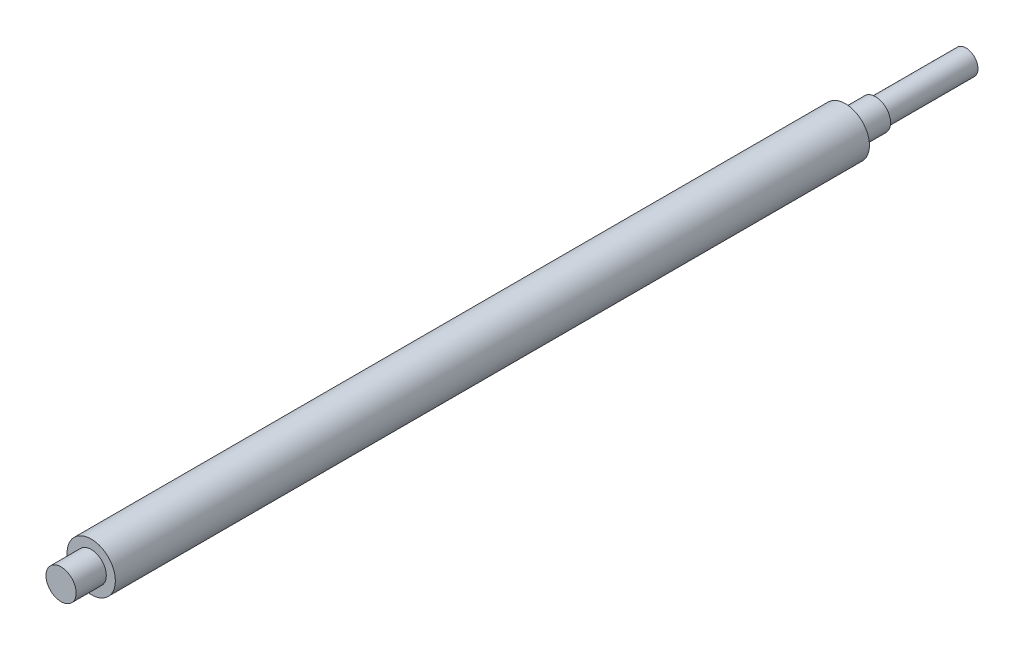
ISO-10303-21;
HEADER;
FILE_DESCRIPTION(('STEP AP214'),'2;1');
FILE_NAME('part.step','',(''),(''),'','','');
FILE_SCHEMA(('AUTOMOTIVE_DESIGN { 1 0 10303 214 1 1 1 1 }'));
ENDSEC;
DATA;
#1=APPLICATION_CONTEXT('core data for automotive mechanical design processes');
#2=APPLICATION_PROTOCOL_DEFINITION('international standard','automotive_design',2000,#1);
#3=PRODUCT_CONTEXT('',#1,'mechanical');
#4=PRODUCT('Part','Part','',(#3));
#5=PRODUCT_RELATED_PRODUCT_CATEGORY('part','',(#4));
#6=PRODUCT_DEFINITION_FORMATION('','',#4);
#7=PRODUCT_DEFINITION_CONTEXT('part definition',#1,'design');
#8=PRODUCT_DEFINITION('design','',#6,#7);
#9=PRODUCT_DEFINITION_SHAPE('','',#8);
#10=(LENGTH_UNIT() NAMED_UNIT(*) SI_UNIT(.MILLI.,.METRE.));
#11=(NAMED_UNIT(*) PLANE_ANGLE_UNIT() SI_UNIT($,.RADIAN.));
#12=(NAMED_UNIT(*) SI_UNIT($,.STERADIAN.) SOLID_ANGLE_UNIT());
#13=UNCERTAINTY_MEASURE_WITH_UNIT(LENGTH_MEASURE(1.E-05),#10,'distance_accuracy_value','');
#14=(GEOMETRIC_REPRESENTATION_CONTEXT(3) GLOBAL_UNCERTAINTY_ASSIGNED_CONTEXT((#13)) GLOBAL_UNIT_ASSIGNED_CONTEXT((#10,
#11,#12)) REPRESENTATION_CONTEXT('',''));
#15=CARTESIAN_POINT('',(0.,0.,0.));
#16=DIRECTION('',(0.,0.,1.));
#17=DIRECTION('',(1.,0.,0.));
#18=AXIS2_PLACEMENT_3D('',#15,#16,#17);
#19=CARTESIAN_POINT('',(0.,0.,250.));
#20=DIRECTION('',(0.,0.,-1.));
#21=DIRECTION('',(-1.,0.,0.));
#22=AXIS2_PLACEMENT_3D('',#19,#20,#21);
#23=CYLINDRICAL_SURFACE('',#22,8.);
#24=CARTESIAN_POINT('',(0.,0.,250.));
#25=DIRECTION('',(0.,0.,1.));
#26=DIRECTION('',(1.,0.,0.));
#27=AXIS2_PLACEMENT_3D('',#24,#25,#26);
#28=CIRCLE('',#27,8.);
#29=CARTESIAN_POINT('',(8.,0.,250.));
#30=VERTEX_POINT('',#29);
#31=EDGE_CURVE('E71',#30,#30,#28,.T.);
#32=ORIENTED_EDGE('',*,*,#31,.F.);
#33=EDGE_LOOP('',(#32));
#34=FACE_BOUND('',#33,.T.);
#35=CARTESIAN_POINT('',(0.,0.,0.));
#36=DIRECTION('',(0.,0.,1.));
#37=DIRECTION('',(1.,0.,0.));
#38=AXIS2_PLACEMENT_3D('',#35,#36,#37);
#39=CIRCLE('',#38,8.);
#40=CARTESIAN_POINT('',(8.,0.,0.));
#41=VERTEX_POINT('',#40);
#42=EDGE_CURVE('E45',#41,#41,#39,.T.);
#43=ORIENTED_EDGE('',*,*,#42,.T.);
#44=EDGE_LOOP('',(#43));
#45=FACE_BOUND('',#44,.T.);
#46=ADVANCED_FACE('F42',(#34,#45),#23,.T.);
#47=CARTESIAN_POINT('',(0.,0.,250.));
#48=DIRECTION('',(0.,0.,1.));
#49=DIRECTION('',(1.,0.,0.));
#50=AXIS2_PLACEMENT_3D('',#47,#48,#49);
#51=PLANE('',#50);
#52=CARTESIAN_POINT('',(0.,0.,250.));
#53=DIRECTION('',(0.,0.,1.));
#54=DIRECTION('',(1.,0.,0.));
#55=AXIS2_PLACEMENT_3D('',#52,#53,#54);
#56=CIRCLE('',#55,5.);
#57=CARTESIAN_POINT('',(5.,0.,250.));
#58=VERTEX_POINT('',#57);
#59=EDGE_CURVE('E56',#58,#58,#56,.T.);
#60=ORIENTED_EDGE('',*,*,#59,.F.);
#61=EDGE_LOOP('',(#60));
#62=FACE_BOUND('',#61,.T.);
#63=ORIENTED_EDGE('',*,*,#31,.T.);
#64=EDGE_LOOP('',(#63));
#65=FACE_BOUND('',#64,.T.);
#66=ADVANCED_FACE('F84',(#62,#65),#51,.T.);
#67=CARTESIAN_POINT('',(0.,0.,0.));
#68=DIRECTION('',(0.,0.,1.));
#69=DIRECTION('',(1.,0.,0.));
#70=AXIS2_PLACEMENT_3D('',#67,#68,#69);
#71=PLANE('',#70);
#72=CARTESIAN_POINT('',(0.,0.,0.));
#73=DIRECTION('',(0.,0.,-1.));
#74=DIRECTION('',(-1.,0.,0.));
#75=AXIS2_PLACEMENT_3D('',#72,#73,#74);
#76=CIRCLE('',#75,5.);
#77=CARTESIAN_POINT('',(-5.,0.,0.));
#78=VERTEX_POINT('',#77);
#79=EDGE_CURVE('E50',#78,#78,#76,.T.);
#80=ORIENTED_EDGE('',*,*,#79,.F.);
#81=EDGE_LOOP('',(#80));
#82=FACE_BOUND('',#81,.T.);
#83=ORIENTED_EDGE('',*,*,#42,.F.);
#84=EDGE_LOOP('',(#83));
#85=FACE_BOUND('',#84,.T.);
#86=ADVANCED_FACE('F81',(#82,#85),#71,.F.);
#87=CARTESIAN_POINT('',(0.,0.,260.));
#88=DIRECTION('',(0.,0.,-1.));
#89=DIRECTION('',(-1.,0.,0.));
#90=AXIS2_PLACEMENT_3D('',#87,#88,#89);
#91=CYLINDRICAL_SURFACE('',#90,5.);
#92=CARTESIAN_POINT('',(0.,0.,260.));
#93=DIRECTION('',(0.,0.,1.));
#94=DIRECTION('',(1.,0.,0.));
#95=AXIS2_PLACEMENT_3D('',#92,#93,#94);
#96=CIRCLE('',#95,5.);
#97=CARTESIAN_POINT('',(5.,0.,260.));
#98=VERTEX_POINT('',#97);
#99=EDGE_CURVE('E64',#98,#98,#96,.T.);
#100=ORIENTED_EDGE('',*,*,#99,.F.);
#101=EDGE_LOOP('',(#100));
#102=FACE_BOUND('',#101,.T.);
#103=ORIENTED_EDGE('',*,*,#59,.T.);
#104=EDGE_LOOP('',(#103));
#105=FACE_BOUND('',#104,.T.);
#106=ADVANCED_FACE('F83',(#102,#105),#91,.T.);
#107=CARTESIAN_POINT('',(0.,0.,260.));
#108=DIRECTION('',(0.,0.,1.));
#109=DIRECTION('',(1.,0.,0.));
#110=AXIS2_PLACEMENT_3D('',#107,#108,#109);
#111=PLANE('',#110);
#112=ORIENTED_EDGE('',*,*,#99,.T.);
#113=EDGE_LOOP('',(#112));
#114=FACE_BOUND('',#113,.T.);
#115=ADVANCED_FACE('F91',(#114),#111,.T.);
#116=CARTESIAN_POINT('',(0.,0.,-10.));
#117=DIRECTION('',(0.,0.,1.));
#118=DIRECTION('',(1.,0.,0.));
#119=AXIS2_PLACEMENT_3D('',#116,#117,#118);
#120=CYLINDRICAL_SURFACE('',#119,5.);
#121=CARTESIAN_POINT('',(0.,0.,-10.));
#122=DIRECTION('',(0.,0.,-1.));
#123=DIRECTION('',(-1.,0.,0.));
#124=AXIS2_PLACEMENT_3D('',#121,#122,#123);
#125=CIRCLE('',#124,5.);
#126=CARTESIAN_POINT('',(-5.,0.,-10.));
#127=VERTEX_POINT('',#126);
#128=EDGE_CURVE('E61',#127,#127,#125,.T.);
#129=ORIENTED_EDGE('',*,*,#128,.F.);
#130=EDGE_LOOP('',(#129));
#131=FACE_BOUND('',#130,.T.);
#132=ORIENTED_EDGE('',*,*,#79,.T.);
#133=EDGE_LOOP('',(#132));
#134=FACE_BOUND('',#133,.T.);
#135=ADVANCED_FACE('F117',(#131,#134),#120,.T.);
#136=CARTESIAN_POINT('',(0.,0.,-10.));
#137=DIRECTION('',(0.,0.,-1.));
#138=DIRECTION('',(-1.,0.,0.));
#139=AXIS2_PLACEMENT_3D('',#136,#137,#138);
#140=PLANE('',#139);
#141=CARTESIAN_POINT('',(0.,0.,-10.));
#142=DIRECTION('',(0.,0.,-1.));
#143=DIRECTION('',(-1.,0.,0.));
#144=AXIS2_PLACEMENT_3D('',#141,#142,#143);
#145=CIRCLE('',#144,4.);
#146=CARTESIAN_POINT('',(-4.,0.,-10.));
#147=VERTEX_POINT('',#146);
#148=EDGE_CURVE('E10',#147,#147,#145,.T.);
#149=ORIENTED_EDGE('',*,*,#148,.F.);
#150=EDGE_LOOP('',(#149));
#151=FACE_BOUND('',#150,.T.);
#152=ORIENTED_EDGE('',*,*,#128,.T.);
#153=EDGE_LOOP('',(#152));
#154=FACE_BOUND('',#153,.T.);
#155=ADVANCED_FACE('F129',(#151,#154),#140,.T.);
#156=CARTESIAN_POINT('',(0.,0.,-40.));
#157=DIRECTION('',(0.,0.,1.));
#158=DIRECTION('',(1.,0.,0.));
#159=AXIS2_PLACEMENT_3D('',#156,#157,#158);
#160=CYLINDRICAL_SURFACE('',#159,4.);
#161=CARTESIAN_POINT('',(0.,0.,-40.));
#162=DIRECTION('',(0.,0.,-1.));
#163=DIRECTION('',(-1.,0.,0.));
#164=AXIS2_PLACEMENT_3D('',#161,#162,#163);
#165=CIRCLE('',#164,4.);
#166=CARTESIAN_POINT('',(-4.,0.,-40.));
#167=VERTEX_POINT('',#166);
#168=EDGE_CURVE('E60',#167,#167,#165,.T.);
#169=ORIENTED_EDGE('',*,*,#168,.F.);
#170=EDGE_LOOP('',(#169));
#171=FACE_BOUND('',#170,.T.);
#172=ORIENTED_EDGE('',*,*,#148,.T.);
#173=EDGE_LOOP('',(#172));
#174=FACE_BOUND('',#173,.T.);
#175=ADVANCED_FACE('F139',(#171,#174),#160,.T.);
#176=CARTESIAN_POINT('',(0.,0.,-40.));
#177=DIRECTION('',(0.,0.,-1.));
#178=DIRECTION('',(-1.,0.,0.));
#179=AXIS2_PLACEMENT_3D('',#176,#177,#178);
#180=PLANE('',#179);
#181=ORIENTED_EDGE('',*,*,#168,.T.);
#182=EDGE_LOOP('',(#181));
#183=FACE_BOUND('',#182,.T.);
#184=ADVANCED_FACE('F149',(#183),#180,.T.);
#185=CLOSED_SHELL('',(#46,#66,#86,#106,#115,#135,#155,#175,#184));
#186=MANIFOLD_SOLID_BREP('B2',#185);
#187=ADVANCED_BREP_SHAPE_REPRESENTATION('',(#18,#186),#14);
#188=SHAPE_DEFINITION_REPRESENTATION(#9,#187);
ENDSEC;
END-ISO-10303-21;
